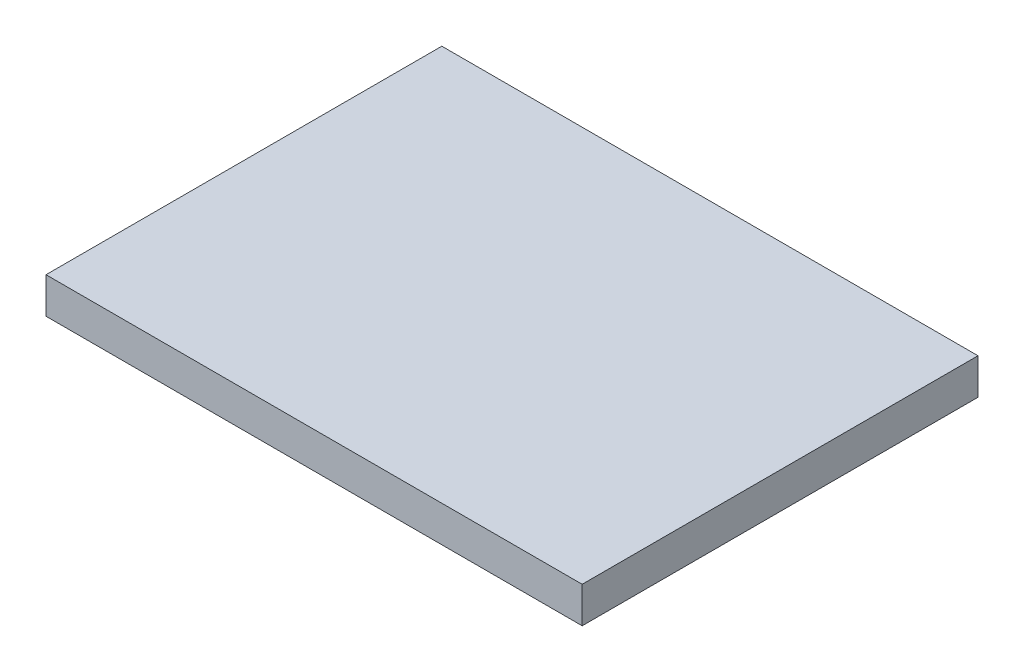
ISO-10303-21;
HEADER;
FILE_DESCRIPTION(('STEP AP214'),'2;1');
FILE_NAME('part.step','',(''),(''),'','','');
FILE_SCHEMA(('AUTOMOTIVE_DESIGN { 1 0 10303 214 1 1 1 1 }'));
ENDSEC;
DATA;
#1=APPLICATION_CONTEXT('core data for automotive mechanical design processes');
#2=APPLICATION_PROTOCOL_DEFINITION('international standard','automotive_design',2000,#1);
#3=PRODUCT_CONTEXT('',#1,'mechanical');
#4=PRODUCT('Part','Part','',(#3));
#5=PRODUCT_RELATED_PRODUCT_CATEGORY('part','',(#4));
#6=PRODUCT_DEFINITION_FORMATION('','',#4);
#7=PRODUCT_DEFINITION_CONTEXT('part definition',#1,'design');
#8=PRODUCT_DEFINITION('design','',#6,#7);
#9=PRODUCT_DEFINITION_SHAPE('','',#8);
#10=(LENGTH_UNIT() NAMED_UNIT(*) SI_UNIT(.MILLI.,.METRE.));
#11=(NAMED_UNIT(*) PLANE_ANGLE_UNIT() SI_UNIT($,.RADIAN.));
#12=(NAMED_UNIT(*) SI_UNIT($,.STERADIAN.) SOLID_ANGLE_UNIT());
#13=UNCERTAINTY_MEASURE_WITH_UNIT(LENGTH_MEASURE(1.E-05),#10,'distance_accuracy_value','');
#14=(GEOMETRIC_REPRESENTATION_CONTEXT(3) GLOBAL_UNCERTAINTY_ASSIGNED_CONTEXT((#13)) GLOBAL_UNIT_ASSIGNED_CONTEXT((#10,
#11,#12)) REPRESENTATION_CONTEXT('',''));
#15=CARTESIAN_POINT('',(0.,0.,0.));
#16=DIRECTION('',(0.,0.,1.));
#17=DIRECTION('',(1.,0.,0.));
#18=AXIS2_PLACEMENT_3D('',#15,#16,#17);
#19=CARTESIAN_POINT('',(14.9,0.,-11.));
#20=DIRECTION('',(-1.,0.,0.));
#21=DIRECTION('',(0.,0.,1.));
#22=AXIS2_PLACEMENT_3D('',#19,#20,#21);
#23=PLANE('',#22);
#24=DIRECTION('',(0.,1.,0.));
#25=VECTOR('',#24,1.);
#26=CARTESIAN_POINT('',(14.9,1.,-11.));
#27=LINE('',#26,#25);
#28=CARTESIAN_POINT('',(14.9,0.,-11.));
#29=VERTEX_POINT('',#28);
#30=CARTESIAN_POINT('',(14.9,2.,-11.));
#31=VERTEX_POINT('',#30);
#32=EDGE_CURVE('E65',#29,#31,#27,.T.);
#33=ORIENTED_EDGE('',*,*,#32,.T.);
#34=DIRECTION('',(0.,0.,1.));
#35=VECTOR('',#34,1.);
#36=CARTESIAN_POINT('',(14.9,2.,0.));
#37=LINE('',#36,#35);
#38=CARTESIAN_POINT('',(14.9,2.,11.));
#39=VERTEX_POINT('',#38);
#40=EDGE_CURVE('E92',#31,#39,#37,.T.);
#41=ORIENTED_EDGE('',*,*,#40,.T.);
#42=DIRECTION('',(0.,-1.,0.));
#43=VECTOR('',#42,1.);
#44=CARTESIAN_POINT('',(14.9,1.,11.));
#45=LINE('',#44,#43);
#46=CARTESIAN_POINT('',(14.9,0.,11.));
#47=VERTEX_POINT('',#46);
#48=EDGE_CURVE('E20',#39,#47,#45,.T.);
#49=ORIENTED_EDGE('',*,*,#48,.T.);
#50=DIRECTION('',(0.,0.,1.));
#51=VECTOR('',#50,1.);
#52=CARTESIAN_POINT('',(14.9,0.,0.));
#53=LINE('',#52,#51);
#54=EDGE_CURVE('E93',#29,#47,#53,.T.);
#55=ORIENTED_EDGE('',*,*,#54,.F.);
#56=EDGE_LOOP('',(#33,#41,#49,#55));
#57=FACE_BOUND('',#56,.T.);
#58=ADVANCED_FACE('F16',(#57),#23,.F.);
#59=CARTESIAN_POINT('',(14.9,0.,11.));
#60=DIRECTION('',(0.,0.,-1.));
#61=DIRECTION('',(-1.,0.,0.));
#62=AXIS2_PLACEMENT_3D('',#59,#60,#61);
#63=PLANE('',#62);
#64=ORIENTED_EDGE('',*,*,#48,.F.);
#65=DIRECTION('',(-1.,0.,0.));
#66=VECTOR('',#65,1.);
#67=CARTESIAN_POINT('',(0.,2.,11.));
#68=LINE('',#67,#66);
#69=CARTESIAN_POINT('',(-14.9,2.,11.));
#70=VERTEX_POINT('',#69);
#71=EDGE_CURVE('E70',#39,#70,#68,.T.);
#72=ORIENTED_EDGE('',*,*,#71,.T.);
#73=DIRECTION('',(0.,-1.,0.));
#74=VECTOR('',#73,1.);
#75=CARTESIAN_POINT('',(-14.9,1.,11.));
#76=LINE('',#75,#74);
#77=CARTESIAN_POINT('',(-14.9,0.,11.));
#78=VERTEX_POINT('',#77);
#79=EDGE_CURVE('E60',#70,#78,#76,.T.);
#80=ORIENTED_EDGE('',*,*,#79,.T.);
#81=DIRECTION('',(-1.,0.,0.));
#82=VECTOR('',#81,1.);
#83=CARTESIAN_POINT('',(0.,0.,11.));
#84=LINE('',#83,#82);
#85=EDGE_CURVE('E105',#47,#78,#84,.T.);
#86=ORIENTED_EDGE('',*,*,#85,.F.);
#87=EDGE_LOOP('',(#64,#72,#80,#86));
#88=FACE_BOUND('',#87,.T.);
#89=ADVANCED_FACE('F76',(#88),#63,.F.);
#90=CARTESIAN_POINT('',(-14.9,0.,11.));
#91=DIRECTION('',(1.,0.,0.));
#92=DIRECTION('',(0.,0.,-1.));
#93=AXIS2_PLACEMENT_3D('',#90,#91,#92);
#94=PLANE('',#93);
#95=ORIENTED_EDGE('',*,*,#79,.F.);
#96=DIRECTION('',(0.,0.,-1.));
#97=VECTOR('',#96,1.);
#98=CARTESIAN_POINT('',(-14.9,2.,0.));
#99=LINE('',#98,#97);
#100=CARTESIAN_POINT('',(-14.9,2.,-11.));
#101=VERTEX_POINT('',#100);
#102=EDGE_CURVE('E63',#70,#101,#99,.T.);
#103=ORIENTED_EDGE('',*,*,#102,.T.);
#104=DIRECTION('',(0.,-1.,0.));
#105=VECTOR('',#104,1.);
#106=CARTESIAN_POINT('',(-14.9,1.,-11.));
#107=LINE('',#106,#105);
#108=CARTESIAN_POINT('',(-14.9,0.,-11.));
#109=VERTEX_POINT('',#108);
#110=EDGE_CURVE('E78',#101,#109,#107,.T.);
#111=ORIENTED_EDGE('',*,*,#110,.T.);
#112=DIRECTION('',(0.,0.,-1.));
#113=VECTOR('',#112,1.);
#114=CARTESIAN_POINT('',(-14.9,0.,0.));
#115=LINE('',#114,#113);
#116=EDGE_CURVE('E27',#78,#109,#115,.T.);
#117=ORIENTED_EDGE('',*,*,#116,.F.);
#118=EDGE_LOOP('',(#95,#103,#111,#117));
#119=FACE_BOUND('',#118,.T.);
#120=ADVANCED_FACE('F62',(#119),#94,.F.);
#121=CARTESIAN_POINT('',(-14.9,0.,-11.));
#122=DIRECTION('',(0.,0.,1.));
#123=DIRECTION('',(1.,0.,0.));
#124=AXIS2_PLACEMENT_3D('',#121,#122,#123);
#125=PLANE('',#124);
#126=ORIENTED_EDGE('',*,*,#110,.F.);
#127=DIRECTION('',(1.,0.,0.));
#128=VECTOR('',#127,1.);
#129=CARTESIAN_POINT('',(0.,2.,-11.));
#130=LINE('',#129,#128);
#131=EDGE_CURVE('E73',#101,#31,#130,.T.);
#132=ORIENTED_EDGE('',*,*,#131,.T.);
#133=ORIENTED_EDGE('',*,*,#32,.F.);
#134=DIRECTION('',(1.,0.,0.));
#135=VECTOR('',#134,1.);
#136=CARTESIAN_POINT('',(0.,0.,-11.));
#137=LINE('',#136,#135);
#138=EDGE_CURVE('E11',#109,#29,#137,.T.);
#139=ORIENTED_EDGE('',*,*,#138,.F.);
#140=EDGE_LOOP('',(#126,#132,#133,#139));
#141=FACE_BOUND('',#140,.T.);
#142=ADVANCED_FACE('F98',(#141),#125,.F.);
#143=CARTESIAN_POINT('',(-14.9,2.,11.));
#144=DIRECTION('',(0.,-1.,0.));
#145=DIRECTION('',(0.,0.,-1.));
#146=AXIS2_PLACEMENT_3D('',#143,#144,#145);
#147=PLANE('',#146);
#148=ORIENTED_EDGE('',*,*,#131,.F.);
#149=ORIENTED_EDGE('',*,*,#102,.F.);
#150=ORIENTED_EDGE('',*,*,#71,.F.);
#151=ORIENTED_EDGE('',*,*,#40,.F.);
#152=EDGE_LOOP('',(#148,#149,#150,#151));
#153=FACE_BOUND('',#152,.T.);
#154=ADVANCED_FACE('F68',(#153),#147,.F.);
#155=CARTESIAN_POINT('',(-14.9,0.,11.));
#156=DIRECTION('',(0.,-1.,0.));
#157=DIRECTION('',(0.,0.,-1.));
#158=AXIS2_PLACEMENT_3D('',#155,#156,#157);
#159=PLANE('',#158);
#160=ORIENTED_EDGE('',*,*,#116,.T.);
#161=ORIENTED_EDGE('',*,*,#138,.T.);
#162=ORIENTED_EDGE('',*,*,#54,.T.);
#163=ORIENTED_EDGE('',*,*,#85,.T.);
#164=EDGE_LOOP('',(#160,#161,#162,#163));
#165=FACE_BOUND('',#164,.T.);
#166=ADVANCED_FACE('F18',(#165),#159,.T.);
#167=CLOSED_SHELL('',(#58,#89,#120,#142,#154,#166));
#168=MANIFOLD_SOLID_BREP('B1',#167);
#169=ADVANCED_BREP_SHAPE_REPRESENTATION('',(#18,#168),#14);
#170=SHAPE_DEFINITION_REPRESENTATION(#9,#169);
ENDSEC;
END-ISO-10303-21;
